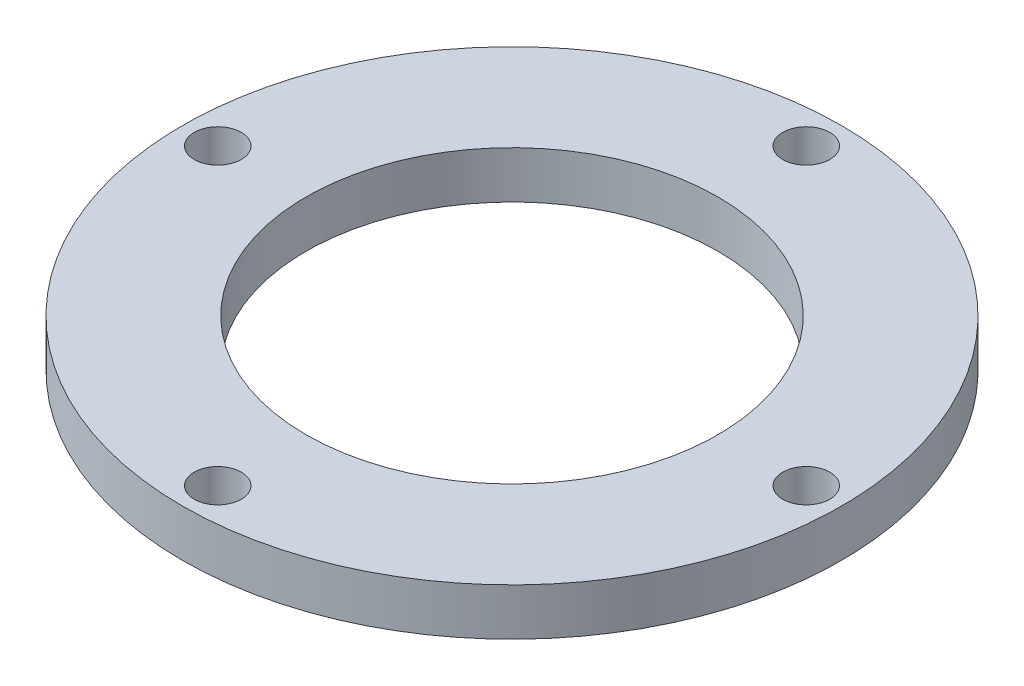
ISO-10303-21;
HEADER;
FILE_DESCRIPTION(('STEP AP214'),'2;1');
FILE_NAME('part.step','',(''),(''),'','','');
FILE_SCHEMA(('AUTOMOTIVE_DESIGN { 1 0 10303 214 1 1 1 1 }'));
ENDSEC;
DATA;
#1=APPLICATION_CONTEXT('core data for automotive mechanical design processes');
#2=APPLICATION_PROTOCOL_DEFINITION('international standard','automotive_design',2000,#1);
#3=PRODUCT_CONTEXT('',#1,'mechanical');
#4=PRODUCT('Part','Part','',(#3));
#5=PRODUCT_RELATED_PRODUCT_CATEGORY('part','',(#4));
#6=PRODUCT_DEFINITION_FORMATION('','',#4);
#7=PRODUCT_DEFINITION_CONTEXT('part definition',#1,'design');
#8=PRODUCT_DEFINITION('design','',#6,#7);
#9=PRODUCT_DEFINITION_SHAPE('','',#8);
#10=(LENGTH_UNIT() NAMED_UNIT(*) SI_UNIT(.MILLI.,.METRE.));
#11=(NAMED_UNIT(*) PLANE_ANGLE_UNIT() SI_UNIT($,.RADIAN.));
#12=(NAMED_UNIT(*) SI_UNIT($,.STERADIAN.) SOLID_ANGLE_UNIT());
#13=UNCERTAINTY_MEASURE_WITH_UNIT(LENGTH_MEASURE(1.E-05),#10,'distance_accuracy_value','');
#14=(GEOMETRIC_REPRESENTATION_CONTEXT(3) GLOBAL_UNCERTAINTY_ASSIGNED_CONTEXT((#13)) GLOBAL_UNIT_ASSIGNED_CONTEXT((#10,
#11,#12)) REPRESENTATION_CONTEXT('',''));
#15=CARTESIAN_POINT('',(0.,0.,0.));
#16=DIRECTION('',(0.,0.,1.));
#17=DIRECTION('',(1.,0.,0.));
#18=AXIS2_PLACEMENT_3D('',#15,#16,#17);
#19=CARTESIAN_POINT('',(0.,8.,0.));
#20=DIRECTION('',(0.,1.,0.));
#21=DIRECTION('',(0.,0.,1.));
#22=AXIS2_PLACEMENT_3D('',#19,#20,#21);
#23=PLANE('',#22);
#24=CARTESIAN_POINT('',(1.41802385452233E-12,8.,50.));
#25=DIRECTION('',(0.,1.,0.));
#26=DIRECTION('',(0.,0.,1.));
#27=AXIS2_PLACEMENT_3D('',#24,#25,#26);
#28=CIRCLE('',#27,4.00000000000152);
#29=CARTESIAN_POINT('',(1.41802385452233E-12,8.,54.0000000000015));
#30=VERTEX_POINT('',#29);
#31=EDGE_CURVE('E72',#30,#30,#28,.T.);
#32=ORIENTED_EDGE('',*,*,#31,.F.);
#33=EDGE_LOOP('',(#32));
#34=FACE_BOUND('',#33,.T.);
#35=CARTESIAN_POINT('',(0.,8.,-50.));
#36=DIRECTION('',(0.,1.,0.));
#37=DIRECTION('',(0.,0.,1.));
#38=AXIS2_PLACEMENT_3D('',#35,#36,#37);
#39=CIRCLE('',#38,4.00000000000152);
#40=CARTESIAN_POINT('',(0.,8.,-45.9999999999985));
#41=VERTEX_POINT('',#40);
#42=EDGE_CURVE('E60',#41,#41,#39,.T.);
#43=ORIENTED_EDGE('',*,*,#42,.F.);
#44=EDGE_LOOP('',(#43));
#45=FACE_BOUND('',#44,.T.);
#46=CARTESIAN_POINT('',(0.,8.,0.));
#47=DIRECTION('',(0.,1.,0.));
#48=DIRECTION('',(0.,0.,1.));
#49=AXIS2_PLACEMENT_3D('',#46,#47,#48);
#50=CIRCLE('',#49,56.);
#51=CARTESIAN_POINT('',(0.,8.,56.));
#52=VERTEX_POINT('',#51);
#53=EDGE_CURVE('E12',#52,#52,#50,.T.);
#54=ORIENTED_EDGE('',*,*,#53,.T.);
#55=EDGE_LOOP('',(#54));
#56=FACE_BOUND('',#55,.T.);
#57=CARTESIAN_POINT('',(0.,8.,0.));
#58=DIRECTION('',(0.,1.,0.));
#59=DIRECTION('',(0.,0.,1.));
#60=AXIS2_PLACEMENT_3D('',#57,#58,#59);
#61=CIRCLE('',#60,35.);
#62=CARTESIAN_POINT('',(0.,8.,35.));
#63=VERTEX_POINT('',#62);
#64=EDGE_CURVE('E55',#63,#63,#61,.T.);
#65=ORIENTED_EDGE('',*,*,#64,.F.);
#66=EDGE_LOOP('',(#65));
#67=FACE_BOUND('',#66,.T.);
#68=CARTESIAN_POINT('',(50.0000000000007,8.,-7.09011927261166E-13));
#69=DIRECTION('',(0.,1.,0.));
#70=DIRECTION('',(0.,0.,1.));
#71=AXIS2_PLACEMENT_3D('',#68,#69,#70);
#72=CIRCLE('',#71,4.00000000000152);
#73=CARTESIAN_POINT('',(50.0000000000007,8.,4.00000000000081));
#74=VERTEX_POINT('',#73);
#75=EDGE_CURVE('E66',#74,#74,#72,.T.);
#76=ORIENTED_EDGE('',*,*,#75,.F.);
#77=EDGE_LOOP('',(#76));
#78=FACE_BOUND('',#77,.T.);
#79=CARTESIAN_POINT('',(-49.9999999999993,8.,7.15135161256903E-13));
#80=DIRECTION('',(0.,1.,0.));
#81=DIRECTION('',(0.,0.,1.));
#82=AXIS2_PLACEMENT_3D('',#79,#80,#81);
#83=CIRCLE('',#82,4.00000000000152);
#84=CARTESIAN_POINT('',(-49.9999999999993,8.,4.00000000000223));
#85=VERTEX_POINT('',#84);
#86=EDGE_CURVE('E78',#85,#85,#83,.T.);
#87=ORIENTED_EDGE('',*,*,#86,.F.);
#88=EDGE_LOOP('',(#87));
#89=FACE_BOUND('',#88,.T.);
#90=ADVANCED_FACE('F44',(#34,#45,#56,#67,#78,#89),#23,.T.);
#91=CARTESIAN_POINT('',(0.,0.,0.));
#92=DIRECTION('',(0.,1.,0.));
#93=DIRECTION('',(0.,0.,1.));
#94=AXIS2_PLACEMENT_3D('',#91,#92,#93);
#95=PLANE('',#94);
#96=CARTESIAN_POINT('',(0.,0.,0.));
#97=DIRECTION('',(0.,1.,0.));
#98=DIRECTION('',(0.,0.,1.));
#99=AXIS2_PLACEMENT_3D('',#96,#97,#98);
#100=CIRCLE('',#99,56.);
#101=CARTESIAN_POINT('',(0.,0.,56.));
#102=VERTEX_POINT('',#101);
#103=EDGE_CURVE('E48',#102,#102,#100,.T.);
#104=ORIENTED_EDGE('',*,*,#103,.F.);
#105=EDGE_LOOP('',(#104));
#106=FACE_BOUND('',#105,.T.);
#107=CARTESIAN_POINT('',(0.,0.,0.));
#108=DIRECTION('',(0.,1.,0.));
#109=DIRECTION('',(0.,0.,1.));
#110=AXIS2_PLACEMENT_3D('',#107,#108,#109);
#111=CIRCLE('',#110,35.);
#112=CARTESIAN_POINT('',(0.,0.,35.));
#113=VERTEX_POINT('',#112);
#114=EDGE_CURVE('E57',#113,#113,#111,.T.);
#115=ORIENTED_EDGE('',*,*,#114,.T.);
#116=EDGE_LOOP('',(#115));
#117=FACE_BOUND('',#116,.T.);
#118=CARTESIAN_POINT('',(0.,0.,-50.));
#119=DIRECTION('',(0.,1.,0.));
#120=DIRECTION('',(0.,0.,1.));
#121=AXIS2_PLACEMENT_3D('',#118,#119,#120);
#122=CIRCLE('',#121,4.00000000000152);
#123=CARTESIAN_POINT('',(0.,0.,-45.9999999999985));
#124=VERTEX_POINT('',#123);
#125=EDGE_CURVE('E63',#124,#124,#122,.T.);
#126=ORIENTED_EDGE('',*,*,#125,.T.);
#127=EDGE_LOOP('',(#126));
#128=FACE_BOUND('',#127,.T.);
#129=CARTESIAN_POINT('',(50.0000000000007,0.,-7.09011927261166E-13));
#130=DIRECTION('',(0.,1.,0.));
#131=DIRECTION('',(0.,0.,1.));
#132=AXIS2_PLACEMENT_3D('',#129,#130,#131);
#133=CIRCLE('',#132,4.00000000000152);
#134=CARTESIAN_POINT('',(50.0000000000007,0.,4.00000000000081));
#135=VERTEX_POINT('',#134);
#136=EDGE_CURVE('E69',#135,#135,#133,.T.);
#137=ORIENTED_EDGE('',*,*,#136,.T.);
#138=EDGE_LOOP('',(#137));
#139=FACE_BOUND('',#138,.T.);
#140=CARTESIAN_POINT('',(1.41802385452233E-12,0.,50.));
#141=DIRECTION('',(0.,1.,0.));
#142=DIRECTION('',(0.,0.,1.));
#143=AXIS2_PLACEMENT_3D('',#140,#141,#142);
#144=CIRCLE('',#143,4.00000000000152);
#145=CARTESIAN_POINT('',(1.41802385452233E-12,0.,54.0000000000015));
#146=VERTEX_POINT('',#145);
#147=EDGE_CURVE('E75',#146,#146,#144,.T.);
#148=ORIENTED_EDGE('',*,*,#147,.T.);
#149=EDGE_LOOP('',(#148));
#150=FACE_BOUND('',#149,.T.);
#151=CARTESIAN_POINT('',(-49.9999999999993,0.,7.15135161256903E-13));
#152=DIRECTION('',(0.,1.,0.));
#153=DIRECTION('',(0.,0.,1.));
#154=AXIS2_PLACEMENT_3D('',#151,#152,#153);
#155=CIRCLE('',#154,4.00000000000152);
#156=CARTESIAN_POINT('',(-49.9999999999993,0.,4.00000000000223));
#157=VERTEX_POINT('',#156);
#158=EDGE_CURVE('E81',#157,#157,#155,.T.);
#159=ORIENTED_EDGE('',*,*,#158,.T.);
#160=EDGE_LOOP('',(#159));
#161=FACE_BOUND('',#160,.T.);
#162=ADVANCED_FACE('F91',(#106,#117,#128,#139,#150,#161),#95,.F.);
#163=CARTESIAN_POINT('',(0.,8.,0.));
#164=DIRECTION('',(0.,-1.,0.));
#165=DIRECTION('',(0.,0.,-1.));
#166=AXIS2_PLACEMENT_3D('',#163,#164,#165);
#167=CYLINDRICAL_SURFACE('',#166,56.);
#168=ORIENTED_EDGE('',*,*,#53,.F.);
#169=EDGE_LOOP('',(#168));
#170=FACE_BOUND('',#169,.T.);
#171=ORIENTED_EDGE('',*,*,#103,.T.);
#172=EDGE_LOOP('',(#171));
#173=FACE_BOUND('',#172,.T.);
#174=ADVANCED_FACE('F46',(#170,#173),#167,.T.);
#175=CARTESIAN_POINT('',(0.,8.,0.));
#176=DIRECTION('',(0.,-1.,0.));
#177=DIRECTION('',(0.,0.,-1.));
#178=AXIS2_PLACEMENT_3D('',#175,#176,#177);
#179=CYLINDRICAL_SURFACE('',#178,35.);
#180=ORIENTED_EDGE('',*,*,#64,.T.);
#181=EDGE_LOOP('',(#180));
#182=FACE_BOUND('',#181,.T.);
#183=ORIENTED_EDGE('',*,*,#114,.F.);
#184=EDGE_LOOP('',(#183));
#185=FACE_BOUND('',#184,.T.);
#186=ADVANCED_FACE('F101',(#182,#185),#179,.F.);
#187=CARTESIAN_POINT('',(0.,8.,-50.));
#188=DIRECTION('',(0.,-1.,0.));
#189=DIRECTION('',(0.,0.,-1.));
#190=AXIS2_PLACEMENT_3D('',#187,#188,#189);
#191=CYLINDRICAL_SURFACE('',#190,4.00000000000152);
#192=ORIENTED_EDGE('',*,*,#42,.T.);
#193=EDGE_LOOP('',(#192));
#194=FACE_BOUND('',#193,.T.);
#195=ORIENTED_EDGE('',*,*,#125,.F.);
#196=EDGE_LOOP('',(#195));
#197=FACE_BOUND('',#196,.T.);
#198=ADVANCED_FACE('F104',(#194,#197),#191,.F.);
#199=CARTESIAN_POINT('',(50.0000000000007,8.,-7.09011927261166E-13));
#200=DIRECTION('',(0.,-1.,0.));
#201=DIRECTION('',(0.,0.,-1.));
#202=AXIS2_PLACEMENT_3D('',#199,#200,#201);
#203=CYLINDRICAL_SURFACE('',#202,4.00000000000152);
#204=ORIENTED_EDGE('',*,*,#75,.T.);
#205=EDGE_LOOP('',(#204));
#206=FACE_BOUND('',#205,.T.);
#207=ORIENTED_EDGE('',*,*,#136,.F.);
#208=EDGE_LOOP('',(#207));
#209=FACE_BOUND('',#208,.T.);
#210=ADVANCED_FACE('F108',(#206,#209),#203,.F.);
#211=CARTESIAN_POINT('',(1.41802385452233E-12,8.,50.));
#212=DIRECTION('',(0.,-1.,0.));
#213=DIRECTION('',(0.,0.,-1.));
#214=AXIS2_PLACEMENT_3D('',#211,#212,#213);
#215=CYLINDRICAL_SURFACE('',#214,4.00000000000152);
#216=ORIENTED_EDGE('',*,*,#31,.T.);
#217=EDGE_LOOP('',(#216));
#218=FACE_BOUND('',#217,.T.);
#219=ORIENTED_EDGE('',*,*,#147,.F.);
#220=EDGE_LOOP('',(#219));
#221=FACE_BOUND('',#220,.T.);
#222=ADVANCED_FACE('F112',(#218,#221),#215,.F.);
#223=CARTESIAN_POINT('',(-49.9999999999993,8.,7.15135161256903E-13));
#224=DIRECTION('',(0.,-1.,0.));
#225=DIRECTION('',(0.,0.,-1.));
#226=AXIS2_PLACEMENT_3D('',#223,#224,#225);
#227=CYLINDRICAL_SURFACE('',#226,4.00000000000152);
#228=ORIENTED_EDGE('',*,*,#86,.T.);
#229=EDGE_LOOP('',(#228));
#230=FACE_BOUND('',#229,.T.);
#231=ORIENTED_EDGE('',*,*,#158,.F.);
#232=EDGE_LOOP('',(#231));
#233=FACE_BOUND('',#232,.T.);
#234=ADVANCED_FACE('F87',(#230,#233),#227,.F.);
#235=CLOSED_SHELL('',(#90,#162,#174,#186,#198,#210,#222,#234));
#236=MANIFOLD_SOLID_BREP('B2',#235);
#237=ADVANCED_BREP_SHAPE_REPRESENTATION('',(#18,#236),#14);
#238=SHAPE_DEFINITION_REPRESENTATION(#9,#237);
ENDSEC;
END-ISO-10303-21;
